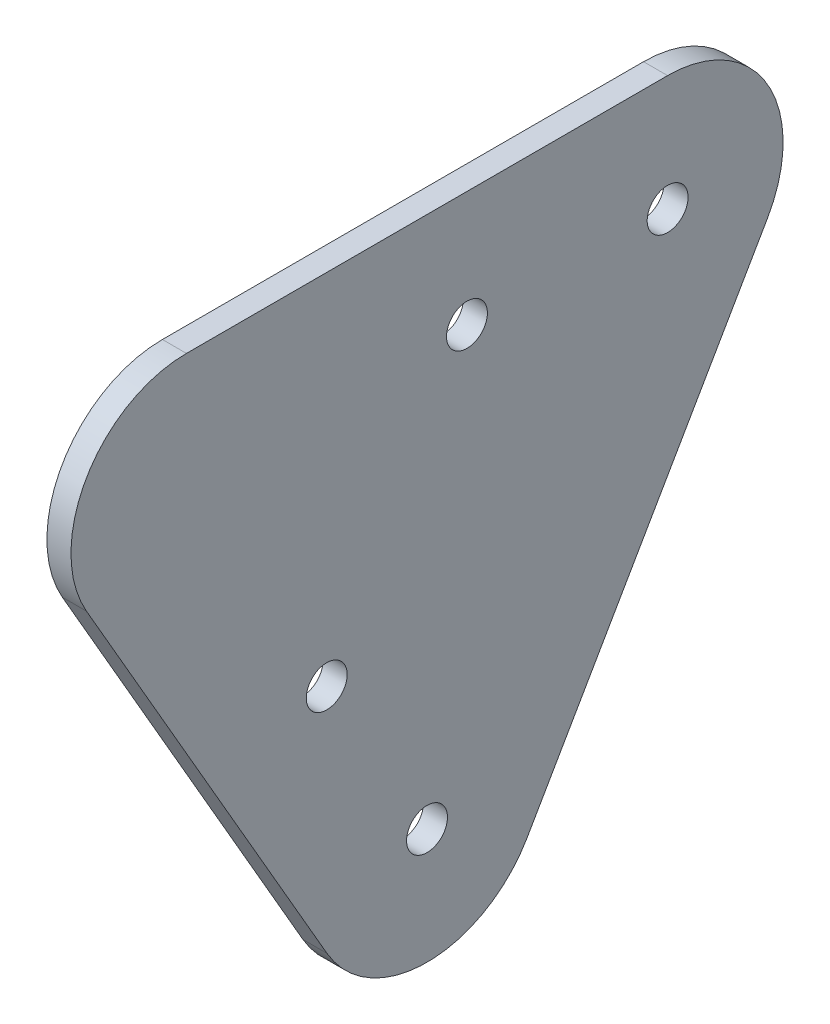
ISO-10303-21;
HEADER;
FILE_DESCRIPTION(('STEP AP214'),'2;1');
FILE_NAME('part.step','',(''),(''),'','','');
FILE_SCHEMA(('AUTOMOTIVE_DESIGN { 1 0 10303 214 1 1 1 1 }'));
ENDSEC;
DATA;
#1=APPLICATION_CONTEXT('core data for automotive mechanical design processes');
#2=APPLICATION_PROTOCOL_DEFINITION('international standard','automotive_design',2000,#1);
#3=PRODUCT_CONTEXT('',#1,'mechanical');
#4=PRODUCT('Part','Part','',(#3));
#5=PRODUCT_RELATED_PRODUCT_CATEGORY('part','',(#4));
#6=PRODUCT_DEFINITION_FORMATION('','',#4);
#7=PRODUCT_DEFINITION_CONTEXT('part definition',#1,'design');
#8=PRODUCT_DEFINITION('design','',#6,#7);
#9=PRODUCT_DEFINITION_SHAPE('','',#8);
#10=(LENGTH_UNIT() NAMED_UNIT(*) SI_UNIT(.MILLI.,.METRE.));
#11=(NAMED_UNIT(*) PLANE_ANGLE_UNIT() SI_UNIT($,.RADIAN.));
#12=(NAMED_UNIT(*) SI_UNIT($,.STERADIAN.) SOLID_ANGLE_UNIT());
#13=UNCERTAINTY_MEASURE_WITH_UNIT(LENGTH_MEASURE(1.E-05),#10,'distance_accuracy_value','');
#14=(GEOMETRIC_REPRESENTATION_CONTEXT(3) GLOBAL_UNCERTAINTY_ASSIGNED_CONTEXT((#13)) GLOBAL_UNIT_ASSIGNED_CONTEXT((#10,
#11,#12)) REPRESENTATION_CONTEXT('',''));
#15=CARTESIAN_POINT('',(0.,0.,0.));
#16=DIRECTION('',(0.,0.,1.));
#17=DIRECTION('',(1.,0.,0.));
#18=AXIS2_PLACEMENT_3D('',#15,#16,#17);
#19=CARTESIAN_POINT('',(5.,0.,0.));
#20=DIRECTION('',(1.,0.,0.));
#21=DIRECTION('',(0.,0.,-1.));
#22=AXIS2_PLACEMENT_3D('',#19,#20,#21);
#23=PLANE('',#22);
#24=DIRECTION('',(0.,0.866025403784436,0.500000000000004));
#25=VECTOR('',#24,1.);
#26=CARTESIAN_POINT('',(5.,-12.0000000000001,20.7846096908265));
#27=LINE('',#26,#25);
#28=CARTESIAN_POINT('',(5.,-12.0000000000001,20.7846096908265));
#29=VERTEX_POINT('',#28);
#30=CARTESIAN_POINT('',(5.,-98.6025403784437,-29.2153903091739));
#31=VERTEX_POINT('',#30);
#32=EDGE_CURVE('E98',#29,#31,#27,.F.);
#33=ORIENTED_EDGE('',*,*,#32,.T.);
#34=CARTESIAN_POINT('',(5.,-86.6025403784436,-50.0000000000004));
#35=DIRECTION('',(-1.,0.,0.));
#36=DIRECTION('',(0.,0.,1.));
#37=AXIS2_PLACEMENT_3D('',#34,#35,#36);
#38=CIRCLE('',#37,24.);
#39=CARTESIAN_POINT('',(5.,-98.6025403784436,-70.784609690827));
#40=VERTEX_POINT('',#39);
#41=EDGE_CURVE('E99',#40,#31,#38,.T.);
#42=ORIENTED_EDGE('',*,*,#41,.F.);
#43=DIRECTION('',(0.,-0.86602540378444,0.499999999999998));
#44=VECTOR('',#43,1.);
#45=CARTESIAN_POINT('',(5.,-55.3012701892218,-95.7846096908268));
#46=LINE('',#45,#44);
#47=CARTESIAN_POINT('',(5.,-12.,-120.784609690827));
#48=VERTEX_POINT('',#47);
#49=EDGE_CURVE('E82',#40,#48,#46,.F.);
#50=ORIENTED_EDGE('',*,*,#49,.T.);
#51=CARTESIAN_POINT('',(5.,0.,-100.));
#52=DIRECTION('',(-1.,0.,0.));
#53=DIRECTION('',(0.,0.,1.));
#54=AXIS2_PLACEMENT_3D('',#51,#52,#53);
#55=CIRCLE('',#54,24.);
#56=CARTESIAN_POINT('',(5.,24.,-100.));
#57=VERTEX_POINT('',#56);
#58=EDGE_CURVE('E76',#57,#48,#55,.T.);
#59=ORIENTED_EDGE('',*,*,#58,.F.);
#60=DIRECTION('',(0.,0.,1.));
#61=VECTOR('',#60,1.);
#62=CARTESIAN_POINT('',(5.,24.,0.));
#63=LINE('',#62,#61);
#64=CARTESIAN_POINT('',(5.,24.,0.));
#65=VERTEX_POINT('',#64);
#66=EDGE_CURVE('E67',#65,#57,#63,.F.);
#67=ORIENTED_EDGE('',*,*,#66,.F.);
#68=CARTESIAN_POINT('',(5.,0.,0.));
#69=DIRECTION('',(-1.,0.,0.));
#70=DIRECTION('',(0.,0.,1.));
#71=AXIS2_PLACEMENT_3D('',#68,#69,#70);
#72=CIRCLE('',#71,24.);
#73=EDGE_CURVE('E92',#29,#65,#72,.T.);
#74=ORIENTED_EDGE('',*,*,#73,.F.);
#75=EDGE_LOOP('',(#33,#42,#50,#59,#67,#74));
#76=FACE_BOUND('',#75,.T.);
#77=CARTESIAN_POINT('',(5.,-86.6025403784436,-50.0000000000004));
#78=DIRECTION('',(-1.,0.,0.));
#79=DIRECTION('',(0.,0.,1.));
#80=AXIS2_PLACEMENT_3D('',#77,#78,#79);
#81=CIRCLE('',#80,4.25000000000002);
#82=CARTESIAN_POINT('',(5.,-86.6025403784436,-45.7500000000004));
#83=VERTEX_POINT('',#82);
#84=EDGE_CURVE('E86',#83,#83,#81,.T.);
#85=ORIENTED_EDGE('',*,*,#84,.T.);
#86=EDGE_LOOP('',(#85));
#87=FACE_BOUND('',#86,.T.);
#88=CARTESIAN_POINT('',(5.,-50.4903810567667,-29.1506350946113));
#89=DIRECTION('',(-1.,0.,0.));
#90=DIRECTION('',(0.,0.,1.));
#91=AXIS2_PLACEMENT_3D('',#88,#89,#90);
#92=CIRCLE('',#91,4.25000000000002);
#93=CARTESIAN_POINT('',(5.,-50.4903810567667,-24.9006350946113));
#94=VERTEX_POINT('',#93);
#95=EDGE_CURVE('E126',#94,#94,#92,.T.);
#96=ORIENTED_EDGE('',*,*,#95,.T.);
#97=EDGE_LOOP('',(#96));
#98=FACE_BOUND('',#97,.T.);
#99=CARTESIAN_POINT('',(5.,0.,-58.3012701892222));
#100=DIRECTION('',(-1.,0.,0.));
#101=DIRECTION('',(0.,0.,1.));
#102=AXIS2_PLACEMENT_3D('',#99,#100,#101);
#103=CIRCLE('',#102,4.25);
#104=CARTESIAN_POINT('',(5.,0.,-54.0512701892222));
#105=VERTEX_POINT('',#104);
#106=EDGE_CURVE('E128',#105,#105,#103,.T.);
#107=ORIENTED_EDGE('',*,*,#106,.T.);
#108=EDGE_LOOP('',(#107));
#109=FACE_BOUND('',#108,.T.);
#110=CARTESIAN_POINT('',(5.,0.,-100.));
#111=DIRECTION('',(-1.,0.,0.));
#112=DIRECTION('',(0.,0.,1.));
#113=AXIS2_PLACEMENT_3D('',#110,#111,#112);
#114=CIRCLE('',#113,4.25);
#115=CARTESIAN_POINT('',(5.,0.,-95.75));
#116=VERTEX_POINT('',#115);
#117=EDGE_CURVE('E20',#116,#116,#114,.T.);
#118=ORIENTED_EDGE('',*,*,#117,.T.);
#119=EDGE_LOOP('',(#118));
#120=FACE_BOUND('',#119,.T.);
#121=ADVANCED_FACE('F17',(#76,#87,#98,#109,#120),#23,.T.);
#122=CARTESIAN_POINT('',(5.,0.,-100.));
#123=DIRECTION('',(-1.,0.,0.));
#124=DIRECTION('',(0.,0.,1.));
#125=AXIS2_PLACEMENT_3D('',#122,#123,#124);
#126=CYLINDRICAL_SURFACE('',#125,4.25);
#127=CARTESIAN_POINT('',(0.,0.,-100.));
#128=DIRECTION('',(-1.,0.,0.));
#129=DIRECTION('',(0.,0.,1.));
#130=AXIS2_PLACEMENT_3D('',#127,#128,#129);
#131=CIRCLE('',#130,4.25);
#132=CARTESIAN_POINT('',(0.,0.,-95.75));
#133=VERTEX_POINT('',#132);
#134=EDGE_CURVE('E118',#133,#133,#131,.T.);
#135=ORIENTED_EDGE('',*,*,#134,.T.);
#136=EDGE_LOOP('',(#135));
#137=FACE_BOUND('',#136,.T.);
#138=ORIENTED_EDGE('',*,*,#117,.F.);
#139=EDGE_LOOP('',(#138));
#140=FACE_BOUND('',#139,.T.);
#141=ADVANCED_FACE('F136',(#137,#140),#126,.F.);
#142=CARTESIAN_POINT('',(5.,0.,-58.3012701892222));
#143=DIRECTION('',(-1.,0.,0.));
#144=DIRECTION('',(0.,0.,1.));
#145=AXIS2_PLACEMENT_3D('',#142,#143,#144);
#146=CYLINDRICAL_SURFACE('',#145,4.25);
#147=CARTESIAN_POINT('',(0.,0.,-58.3012701892222));
#148=DIRECTION('',(-1.,0.,0.));
#149=DIRECTION('',(0.,0.,1.));
#150=AXIS2_PLACEMENT_3D('',#147,#148,#149);
#151=CIRCLE('',#150,4.25);
#152=CARTESIAN_POINT('',(0.,0.,-54.0512701892222));
#153=VERTEX_POINT('',#152);
#154=EDGE_CURVE('E115',#153,#153,#151,.T.);
#155=ORIENTED_EDGE('',*,*,#154,.T.);
#156=EDGE_LOOP('',(#155));
#157=FACE_BOUND('',#156,.T.);
#158=ORIENTED_EDGE('',*,*,#106,.F.);
#159=EDGE_LOOP('',(#158));
#160=FACE_BOUND('',#159,.T.);
#161=ADVANCED_FACE('F138',(#157,#160),#146,.F.);
#162=CARTESIAN_POINT('',(5.,-50.4903810567667,-29.1506350946113));
#163=DIRECTION('',(-1.,0.,0.));
#164=DIRECTION('',(0.,0.,1.));
#165=AXIS2_PLACEMENT_3D('',#162,#163,#164);
#166=CYLINDRICAL_SURFACE('',#165,4.25000000000002);
#167=CARTESIAN_POINT('',(0.,-50.4903810567667,-29.1506350946113));
#168=DIRECTION('',(-1.,0.,0.));
#169=DIRECTION('',(0.,0.,1.));
#170=AXIS2_PLACEMENT_3D('',#167,#168,#169);
#171=CIRCLE('',#170,4.25000000000002);
#172=CARTESIAN_POINT('',(0.,-50.4903810567667,-24.9006350946113));
#173=VERTEX_POINT('',#172);
#174=EDGE_CURVE('E112',#173,#173,#171,.T.);
#175=ORIENTED_EDGE('',*,*,#174,.T.);
#176=EDGE_LOOP('',(#175));
#177=FACE_BOUND('',#176,.T.);
#178=ORIENTED_EDGE('',*,*,#95,.F.);
#179=EDGE_LOOP('',(#178));
#180=FACE_BOUND('',#179,.T.);
#181=ADVANCED_FACE('F145',(#177,#180),#166,.F.);
#182=CARTESIAN_POINT('',(5.,-86.6025403784436,-50.0000000000004));
#183=DIRECTION('',(-1.,0.,0.));
#184=DIRECTION('',(0.,0.,1.));
#185=AXIS2_PLACEMENT_3D('',#182,#183,#184);
#186=CYLINDRICAL_SURFACE('',#185,4.25000000000002);
#187=CARTESIAN_POINT('',(0.,-86.6025403784436,-50.0000000000004));
#188=DIRECTION('',(-1.,0.,0.));
#189=DIRECTION('',(0.,0.,1.));
#190=AXIS2_PLACEMENT_3D('',#187,#188,#189);
#191=CIRCLE('',#190,4.25000000000002);
#192=CARTESIAN_POINT('',(0.,-86.6025403784436,-45.7500000000004));
#193=VERTEX_POINT('',#192);
#194=EDGE_CURVE('E109',#193,#193,#191,.T.);
#195=ORIENTED_EDGE('',*,*,#194,.T.);
#196=EDGE_LOOP('',(#195));
#197=FACE_BOUND('',#196,.T.);
#198=ORIENTED_EDGE('',*,*,#84,.F.);
#199=EDGE_LOOP('',(#198));
#200=FACE_BOUND('',#199,.T.);
#201=ADVANCED_FACE('F176',(#197,#200),#186,.F.);
#202=CARTESIAN_POINT('',(5.,0.,-100.));
#203=DIRECTION('',(-1.,0.,0.));
#204=DIRECTION('',(0.,0.,1.));
#205=AXIS2_PLACEMENT_3D('',#202,#203,#204);
#206=CYLINDRICAL_SURFACE('',#205,24.);
#207=ORIENTED_EDGE('',*,*,#58,.T.);
#208=DIRECTION('',(1.,0.,0.));
#209=VECTOR('',#208,1.);
#210=CARTESIAN_POINT('',(5.,-11.9999999999999,-120.784609690827));
#211=LINE('',#210,#209);
#212=CARTESIAN_POINT('',(0.,-11.9999999999999,-120.784609690827));
#213=VERTEX_POINT('',#212);
#214=EDGE_CURVE('E97',#48,#213,#211,.F.);
#215=ORIENTED_EDGE('',*,*,#214,.T.);
#216=CARTESIAN_POINT('',(0.,0.,-100.));
#217=DIRECTION('',(-1.,0.,0.));
#218=DIRECTION('',(0.,0.,1.));
#219=AXIS2_PLACEMENT_3D('',#216,#217,#218);
#220=CIRCLE('',#219,24.);
#221=CARTESIAN_POINT('',(0.,24.,-100.));
#222=VERTEX_POINT('',#221);
#223=EDGE_CURVE('E90',#213,#222,#220,.F.);
#224=ORIENTED_EDGE('',*,*,#223,.T.);
#225=DIRECTION('',(1.,0.,0.));
#226=VECTOR('',#225,1.);
#227=CARTESIAN_POINT('',(5.,24.,-100.));
#228=LINE('',#227,#226);
#229=EDGE_CURVE('E72',#57,#222,#228,.F.);
#230=ORIENTED_EDGE('',*,*,#229,.F.);
#231=EDGE_LOOP('',(#207,#215,#224,#230));
#232=FACE_BOUND('',#231,.T.);
#233=ADVANCED_FACE('F89',(#232),#206,.T.);
#234=CARTESIAN_POINT('',(5.,24.,0.));
#235=DIRECTION('',(0.,1.,0.));
#236=DIRECTION('',(0.,0.,1.));
#237=AXIS2_PLACEMENT_3D('',#234,#235,#236);
#238=PLANE('',#237);
#239=ORIENTED_EDGE('',*,*,#66,.T.);
#240=ORIENTED_EDGE('',*,*,#229,.T.);
#241=DIRECTION('',(0.,0.,-1.));
#242=VECTOR('',#241,1.);
#243=CARTESIAN_POINT('',(0.,24.,0.));
#244=LINE('',#243,#242);
#245=CARTESIAN_POINT('',(0.,24.,0.));
#246=VERTEX_POINT('',#245);
#247=EDGE_CURVE('E107',#222,#246,#244,.F.);
#248=ORIENTED_EDGE('',*,*,#247,.T.);
#249=DIRECTION('',(-1.,0.,0.));
#250=VECTOR('',#249,1.);
#251=CARTESIAN_POINT('',(5.,24.,0.));
#252=LINE('',#251,#250);
#253=EDGE_CURVE('E74',#65,#246,#252,.T.);
#254=ORIENTED_EDGE('',*,*,#253,.F.);
#255=EDGE_LOOP('',(#239,#240,#248,#254));
#256=FACE_BOUND('',#255,.T.);
#257=ADVANCED_FACE('F69',(#256),#238,.T.);
#258=CARTESIAN_POINT('',(5.,0.,0.));
#259=DIRECTION('',(-1.,0.,0.));
#260=DIRECTION('',(0.,0.,1.));
#261=AXIS2_PLACEMENT_3D('',#258,#259,#260);
#262=CYLINDRICAL_SURFACE('',#261,24.);
#263=CARTESIAN_POINT('',(0.,0.,0.));
#264=DIRECTION('',(-1.,0.,0.));
#265=DIRECTION('',(0.,0.,1.));
#266=AXIS2_PLACEMENT_3D('',#263,#264,#265);
#267=CIRCLE('',#266,24.);
#268=CARTESIAN_POINT('',(0.,-12.0000000000001,20.7846096908265));
#269=VERTEX_POINT('',#268);
#270=EDGE_CURVE('E105',#246,#269,#267,.F.);
#271=ORIENTED_EDGE('',*,*,#270,.T.);
#272=DIRECTION('',(1.,0.,0.));
#273=VECTOR('',#272,1.);
#274=CARTESIAN_POINT('',(5.,-12.0000000000001,20.7846096908265));
#275=LINE('',#274,#273);
#276=EDGE_CURVE('E100',#269,#29,#275,.T.);
#277=ORIENTED_EDGE('',*,*,#276,.T.);
#278=ORIENTED_EDGE('',*,*,#73,.T.);
#279=ORIENTED_EDGE('',*,*,#253,.T.);
#280=EDGE_LOOP('',(#271,#277,#278,#279));
#281=FACE_BOUND('',#280,.T.);
#282=ADVANCED_FACE('F167',(#281),#262,.T.);
#283=CARTESIAN_POINT('',(5.,-12.0000000000001,20.7846096908265));
#284=DIRECTION('',(0.,0.500000000000004,-0.866025403784436));
#285=DIRECTION('',(0.,0.866025403784436,0.500000000000004));
#286=AXIS2_PLACEMENT_3D('',#283,#284,#285);
#287=PLANE('',#286);
#288=DIRECTION('',(-1.,0.,0.));
#289=VECTOR('',#288,1.);
#290=CARTESIAN_POINT('',(5.,-98.6025403784437,-29.215390309174));
#291=LINE('',#290,#289);
#292=CARTESIAN_POINT('',(0.,-98.6025403784437,-29.2153903091739));
#293=VERTEX_POINT('',#292);
#294=EDGE_CURVE('E122',#31,#293,#291,.T.);
#295=ORIENTED_EDGE('',*,*,#294,.F.);
#296=ORIENTED_EDGE('',*,*,#32,.F.);
#297=ORIENTED_EDGE('',*,*,#276,.F.);
#298=DIRECTION('',(0.,-0.866025403784436,-0.500000000000004));
#299=VECTOR('',#298,1.);
#300=CARTESIAN_POINT('',(0.,-12.0000000000001,20.7846096908265));
#301=LINE('',#300,#299);
#302=EDGE_CURVE('E104',#269,#293,#301,.T.);
#303=ORIENTED_EDGE('',*,*,#302,.T.);
#304=EDGE_LOOP('',(#295,#296,#297,#303));
#305=FACE_BOUND('',#304,.T.);
#306=ADVANCED_FACE('F163',(#305),#287,.F.);
#307=CARTESIAN_POINT('',(5.,-86.6025403784436,-50.0000000000004));
#308=DIRECTION('',(-1.,0.,0.));
#309=DIRECTION('',(0.,0.,1.));
#310=AXIS2_PLACEMENT_3D('',#307,#308,#309);
#311=CYLINDRICAL_SURFACE('',#310,24.);
#312=ORIENTED_EDGE('',*,*,#41,.T.);
#313=ORIENTED_EDGE('',*,*,#294,.T.);
#314=CARTESIAN_POINT('',(0.,-86.6025403784436,-50.0000000000004));
#315=DIRECTION('',(-1.,0.,0.));
#316=DIRECTION('',(0.,0.,1.));
#317=AXIS2_PLACEMENT_3D('',#314,#315,#316);
#318=CIRCLE('',#317,24.);
#319=CARTESIAN_POINT('',(0.,-98.6025403784436,-70.784609690827));
#320=VERTEX_POINT('',#319);
#321=EDGE_CURVE('E26',#293,#320,#318,.F.);
#322=ORIENTED_EDGE('',*,*,#321,.T.);
#323=DIRECTION('',(1.,0.,0.));
#324=VECTOR('',#323,1.);
#325=CARTESIAN_POINT('',(5.,-98.6025403784436,-70.784609690827));
#326=LINE('',#325,#324);
#327=EDGE_CURVE('E34',#320,#40,#326,.T.);
#328=ORIENTED_EDGE('',*,*,#327,.T.);
#329=EDGE_LOOP('',(#312,#313,#322,#328));
#330=FACE_BOUND('',#329,.T.);
#331=ADVANCED_FACE('F156',(#330),#311,.T.);
#332=CARTESIAN_POINT('',(5.,-55.3012701892218,-95.7846096908268));
#333=DIRECTION('',(0.,0.499999999999998,0.86602540378444));
#334=DIRECTION('',(0.,-0.86602540378444,0.499999999999998));
#335=AXIS2_PLACEMENT_3D('',#332,#333,#334);
#336=PLANE('',#335);
#337=ORIENTED_EDGE('',*,*,#214,.F.);
#338=ORIENTED_EDGE('',*,*,#49,.F.);
#339=ORIENTED_EDGE('',*,*,#327,.F.);
#340=DIRECTION('',(0.,0.86602540378444,-0.499999999999998));
#341=VECTOR('',#340,1.);
#342=CARTESIAN_POINT('',(0.,-98.6025403784435,-70.784609690827));
#343=LINE('',#342,#341);
#344=EDGE_CURVE('E11',#320,#213,#343,.T.);
#345=ORIENTED_EDGE('',*,*,#344,.T.);
#346=EDGE_LOOP('',(#337,#338,#339,#345));
#347=FACE_BOUND('',#346,.T.);
#348=ADVANCED_FACE('F150',(#347),#336,.F.);
#349=CARTESIAN_POINT('',(0.,0.,0.));
#350=DIRECTION('',(1.,0.,0.));
#351=DIRECTION('',(0.,0.,-1.));
#352=AXIS2_PLACEMENT_3D('',#349,#350,#351);
#353=PLANE('',#352);
#354=ORIENTED_EDGE('',*,*,#321,.F.);
#355=ORIENTED_EDGE('',*,*,#302,.F.);
#356=ORIENTED_EDGE('',*,*,#270,.F.);
#357=ORIENTED_EDGE('',*,*,#247,.F.);
#358=ORIENTED_EDGE('',*,*,#223,.F.);
#359=ORIENTED_EDGE('',*,*,#344,.F.);
#360=EDGE_LOOP('',(#354,#355,#356,#357,#358,#359));
#361=FACE_BOUND('',#360,.T.);
#362=ORIENTED_EDGE('',*,*,#194,.F.);
#363=EDGE_LOOP('',(#362));
#364=FACE_BOUND('',#363,.T.);
#365=ORIENTED_EDGE('',*,*,#174,.F.);
#366=EDGE_LOOP('',(#365));
#367=FACE_BOUND('',#366,.T.);
#368=ORIENTED_EDGE('',*,*,#154,.F.);
#369=EDGE_LOOP('',(#368));
#370=FACE_BOUND('',#369,.T.);
#371=ORIENTED_EDGE('',*,*,#134,.F.);
#372=EDGE_LOOP('',(#371));
#373=FACE_BOUND('',#372,.T.);
#374=ADVANCED_FACE('F148',(#361,#364,#367,#370,#373),#353,.F.);
#375=CLOSED_SHELL('',(#121,#141,#161,#181,#201,#233,#257,#282,#306,#331,#348,#374));
#376=MANIFOLD_SOLID_BREP('B1',#375);
#377=ADVANCED_BREP_SHAPE_REPRESENTATION('',(#18,#376),#14);
#378=SHAPE_DEFINITION_REPRESENTATION(#9,#377);
ENDSEC;
END-ISO-10303-21;
